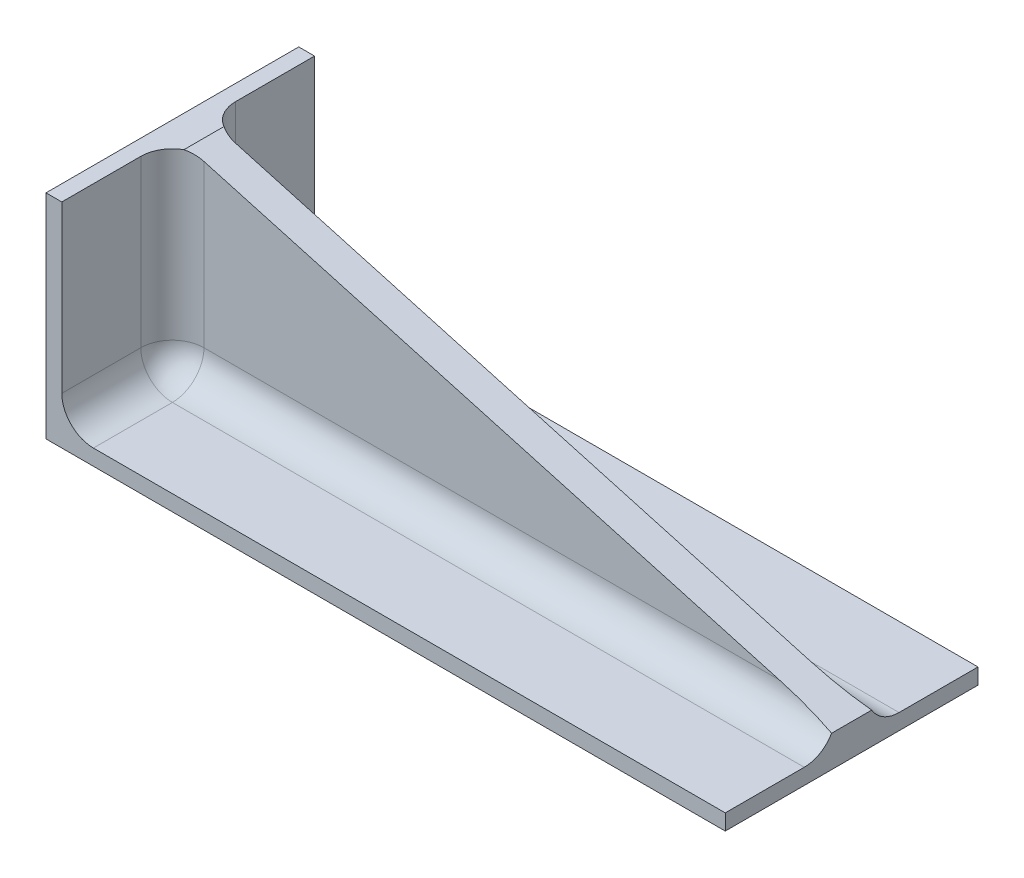
ISO-10303-21;
HEADER;
FILE_DESCRIPTION(('STEP AP214'),'2;1');
FILE_NAME('part.step','',(''),(''),'','','');
FILE_SCHEMA(('AUTOMOTIVE_DESIGN { 1 0 10303 214 1 1 1 1 }'));
ENDSEC;
DATA;
#1=APPLICATION_CONTEXT('core data for automotive mechanical design processes');
#2=APPLICATION_PROTOCOL_DEFINITION('international standard','automotive_design',2000,#1);
#3=PRODUCT_CONTEXT('',#1,'mechanical');
#4=PRODUCT('Part','Part','',(#3));
#5=PRODUCT_RELATED_PRODUCT_CATEGORY('part','',(#4));
#6=PRODUCT_DEFINITION_FORMATION('','',#4);
#7=PRODUCT_DEFINITION_CONTEXT('part definition',#1,'design');
#8=PRODUCT_DEFINITION('design','',#6,#7);
#9=PRODUCT_DEFINITION_SHAPE('','',#8);
#10=(LENGTH_UNIT() NAMED_UNIT(*) SI_UNIT(.MILLI.,.METRE.));
#11=(NAMED_UNIT(*) PLANE_ANGLE_UNIT() SI_UNIT($,.RADIAN.));
#12=(NAMED_UNIT(*) SI_UNIT($,.STERADIAN.) SOLID_ANGLE_UNIT());
#13=UNCERTAINTY_MEASURE_WITH_UNIT(LENGTH_MEASURE(1.E-05),#10,'distance_accuracy_value','');
#14=(GEOMETRIC_REPRESENTATION_CONTEXT(3) GLOBAL_UNCERTAINTY_ASSIGNED_CONTEXT((#13)) GLOBAL_UNIT_ASSIGNED_CONTEXT((#10,
#11,#12)) REPRESENTATION_CONTEXT('',''));
#15=CARTESIAN_POINT('',(0.,0.,0.));
#16=DIRECTION('',(0.,0.,1.));
#17=DIRECTION('',(1.,0.,0.));
#18=AXIS2_PLACEMENT_3D('',#15,#16,#17);
#19=CARTESIAN_POINT('',(0.,6.52256026967279E-13,0.499999999999896));
#20=DIRECTION('',(0.,0.,1.));
#21=DIRECTION('',(1.,0.,0.));
#22=AXIS2_PLACEMENT_3D('',#19,#20,#21);
#23=PLANE('',#22);
#24=DIRECTION('',(0.,-1.00000000000001,0.));
#25=VECTOR('',#24,1.);
#26=CARTESIAN_POINT('',(1.50000000000002,6.52256026967279E-13,0.499999999999884));
#27=LINE('',#26,#25);
#28=CARTESIAN_POINT('',(1.50000000000002,6.60605181463442,0.499999999999971));
#29=VERTEX_POINT('',#28);
#30=CARTESIAN_POINT('',(1.50000000000002,1.50000000000065,0.49999999999995));
#31=VERTEX_POINT('',#30);
#32=EDGE_CURVE('E234',#29,#31,#27,.T.);
#33=ORIENTED_EDGE('',*,*,#32,.T.);
#34=DIRECTION('',(1.,0.,0.));
#35=VECTOR('',#34,1.);
#36=CARTESIAN_POINT('',(0.,1.50000000000065,0.499999999999948));
#37=LINE('',#36,#35);
#38=CARTESIAN_POINT('',(19.7162134188814,1.5000000000007,0.499999999999936));
#39=VERTEX_POINT('',#38);
#40=EDGE_CURVE('E236',#31,#39,#37,.T.);
#41=ORIENTED_EDGE('',*,*,#40,.T.);
#42=DIRECTION('',(-0.962888331678778,0.269900093954894,0.));
#43=VECTOR('',#42,1.);
#44=CARTESIAN_POINT('',(21.5,1.00000000000075,0.499999999999926));
#45=LINE('',#44,#43);
#46=EDGE_CURVE('E203',#39,#29,#45,.T.);
#47=ORIENTED_EDGE('',*,*,#46,.T.);
#48=EDGE_LOOP('',(#33,#41,#47));
#49=FACE_BOUND('',#48,.T.);
#50=ADVANCED_FACE('F32',(#49),#23,.T.);
#51=CARTESIAN_POINT('',(0.,6.24500451351651E-13,-0.50000000000008));
#52=DIRECTION('',(0.,0.,1.));
#53=DIRECTION('',(1.,0.,0.));
#54=AXIS2_PLACEMENT_3D('',#51,#52,#53);
#55=PLANE('',#54);
#56=DIRECTION('',(1.,0.,0.));
#57=VECTOR('',#56,1.);
#58=CARTESIAN_POINT('',(0.500000000000014,1.50000000000038,-0.500000000000091));
#59=LINE('',#58,#57);
#60=CARTESIAN_POINT('',(19.7162134188814,1.5000000000007,-0.500000000000072));
#61=VERTEX_POINT('',#60);
#62=CARTESIAN_POINT('',(1.50000000000002,1.50000000000038,-0.500000000000091));
#63=VERTEX_POINT('',#62);
#64=EDGE_CURVE('E217',#61,#63,#59,.F.);
#65=ORIENTED_EDGE('',*,*,#64,.T.);
#66=DIRECTION('',(0.,-1.00000000000001,0.));
#67=VECTOR('',#66,1.);
#68=CARTESIAN_POINT('',(1.50000000000002,6.74620311000002,-0.500000000000013));
#69=LINE('',#68,#67);
#70=CARTESIAN_POINT('',(1.50000000000002,6.60605181463447,-0.500000000000016));
#71=VERTEX_POINT('',#70);
#72=EDGE_CURVE('E219',#63,#71,#69,.F.);
#73=ORIENTED_EDGE('',*,*,#72,.T.);
#74=DIRECTION('',(-0.962888331678778,0.269900093954894,0.));
#75=VECTOR('',#74,1.);
#76=CARTESIAN_POINT('',(21.5,1.00000000000081,-0.500000000000056));
#77=LINE('',#76,#75);
#78=EDGE_CURVE('E202',#61,#71,#77,.T.);
#79=ORIENTED_EDGE('',*,*,#78,.F.);
#80=EDGE_LOOP('',(#65,#73,#79));
#81=FACE_BOUND('',#80,.T.);
#82=ADVANCED_FACE('F310',(#81),#55,.F.);
#83=CARTESIAN_POINT('',(0.,6.74620311000086,0.500000000000032));
#84=DIRECTION('',(1.,0.,0.));
#85=DIRECTION('',(0.,1.00000000000001,0.));
#86=AXIS2_PLACEMENT_3D('',#83,#84,#85);
#87=PLANE('',#86);
#88=DIRECTION('',(0.,0.,-1.));
#89=VECTOR('',#88,1.);
#90=CARTESIAN_POINT('',(0.,6.74620311000086,0.500000000000032));
#91=LINE('',#90,#89);
#92=CARTESIAN_POINT('',(0.,6.74620311000072,4.00000000000003));
#93=VERTEX_POINT('',#92);
#94=CARTESIAN_POINT('',(0.,6.74620311000056,-4.00000000000005));
#95=VERTEX_POINT('',#94);
#96=EDGE_CURVE('E206',#93,#95,#91,.T.);
#97=ORIENTED_EDGE('',*,*,#96,.T.);
#98=DIRECTION('',(0.,-1.00000000000001,0.));
#99=VECTOR('',#98,1.);
#100=CARTESIAN_POINT('',(0.,4.30211422042248E-13,-4.00000000000006));
#101=LINE('',#100,#99);
#102=CARTESIAN_POINT('',(0.,4.30211422042248E-13,-4.00000000000006));
#103=VERTEX_POINT('',#102);
#104=EDGE_CURVE('E152',#95,#103,#101,.T.);
#105=ORIENTED_EDGE('',*,*,#104,.T.);
#106=DIRECTION('',(0.,0.,-1.));
#107=VECTOR('',#106,1.);
#108=CARTESIAN_POINT('',(0.,6.52256026967279E-13,0.499999999999896));
#109=LINE('',#108,#107);
#110=CARTESIAN_POINT('',(0.,4.71844785465692E-13,3.99999999999988));
#111=VERTEX_POINT('',#110);
#112=EDGE_CURVE('E146',#111,#103,#109,.T.);
#113=ORIENTED_EDGE('',*,*,#112,.F.);
#114=DIRECTION('',(0.,-1.00000000000001,0.));
#115=VECTOR('',#114,1.);
#116=CARTESIAN_POINT('',(0.,4.71844785465692E-13,3.99999999999988));
#117=LINE('',#116,#115);
#118=EDGE_CURVE('E150',#93,#111,#117,.T.);
#119=ORIENTED_EDGE('',*,*,#118,.F.);
#120=EDGE_LOOP('',(#97,#105,#113,#119));
#121=FACE_BOUND('',#120,.T.);
#122=ADVANCED_FACE('F148',(#121),#87,.F.);
#123=CARTESIAN_POINT('',(0.,6.52256026967279E-13,0.499999999999896));
#124=DIRECTION('',(0.,1.00000000000001,0.));
#125=DIRECTION('',(0.,0.,1.));
#126=AXIS2_PLACEMENT_3D('',#123,#124,#125);
#127=PLANE('',#126);
#128=ORIENTED_EDGE('',*,*,#112,.T.);
#129=DIRECTION('',(1.,0.,0.));
#130=VECTOR('',#129,1.);
#131=CARTESIAN_POINT('',(21.5,6.10622663543836E-13,-4.00000000000003));
#132=LINE('',#131,#130);
#133=CARTESIAN_POINT('',(21.5,6.10622663543836E-13,-4.00000000000003));
#134=VERTEX_POINT('',#133);
#135=EDGE_CURVE('E185',#103,#134,#132,.T.);
#136=ORIENTED_EDGE('',*,*,#135,.T.);
#137=DIRECTION('',(0.,0.,-1.));
#138=VECTOR('',#137,1.);
#139=CARTESIAN_POINT('',(21.5,8.04911692853238E-13,0.499999999999876));
#140=LINE('',#139,#138);
#141=CARTESIAN_POINT('',(21.5,4.30211422042248E-13,3.99999999999985));
#142=VERTEX_POINT('',#141);
#143=EDGE_CURVE('E157',#142,#134,#140,.T.);
#144=ORIENTED_EDGE('',*,*,#143,.F.);
#145=DIRECTION('',(1.,0.,0.));
#146=VECTOR('',#145,1.);
#147=CARTESIAN_POINT('',(21.5,4.30211422042248E-13,3.99999999999985));
#148=LINE('',#147,#146);
#149=EDGE_CURVE('E160',#111,#142,#148,.T.);
#150=ORIENTED_EDGE('',*,*,#149,.F.);
#151=EDGE_LOOP('',(#128,#136,#144,#150));
#152=FACE_BOUND('',#151,.T.);
#153=ADVANCED_FACE('F161',(#152),#127,.F.);
#154=CARTESIAN_POINT('',(21.5,8.04911692853238E-13,0.499999999999876));
#155=DIRECTION('',(-1.,0.,0.));
#156=DIRECTION('',(0.,0.,1.));
#157=AXIS2_PLACEMENT_3D('',#154,#155,#156);
#158=PLANE('',#157);
#159=ORIENTED_EDGE('',*,*,#143,.T.);
#160=DIRECTION('',(0.,1.00000000000001,0.));
#161=VECTOR('',#160,1.);
#162=CARTESIAN_POINT('',(21.5,0.500000000000528,-4.00000000000004));
#163=LINE('',#162,#161);
#164=CARTESIAN_POINT('',(21.5,0.500000000000528,-4.00000000000004));
#165=VERTEX_POINT('',#164);
#166=EDGE_CURVE('E188',#134,#165,#163,.T.);
#167=ORIENTED_EDGE('',*,*,#166,.T.);
#168=DIRECTION('',(0.,0.,-1.));
#169=VECTOR('',#168,1.);
#170=CARTESIAN_POINT('',(21.5,0.500000000000556,3.99999999999993));
#171=LINE('',#170,#169);
#172=CARTESIAN_POINT('',(21.5,0.500000000000972,-1.50000000000008));
#173=VERTEX_POINT('',#172);
#174=EDGE_CURVE('E198',#173,#165,#171,.T.);
#175=ORIENTED_EDGE('',*,*,#174,.F.);
#176=CARTESIAN_POINT('',(21.5,1.50000000000089,-1.50000000000007));
#177=DIRECTION('',(-1.,0.,0.));
#178=DIRECTION('',(0.,0.,1.));
#179=AXIS2_PLACEMENT_3D('',#176,#177,#178);
#180=CIRCLE('',#179,1.);
#181=CARTESIAN_POINT('',(21.5,1.00000000000088,-0.633974596215661));
#182=VERTEX_POINT('',#181);
#183=EDGE_CURVE('E244',#173,#182,#180,.T.);
#184=ORIENTED_EDGE('',*,*,#183,.T.);
#185=DIRECTION('',(0.,0.,-1.));
#186=VECTOR('',#185,1.);
#187=CARTESIAN_POINT('',(21.5,1.00000000000075,0.499999999999926));
#188=LINE('',#187,#186);
#189=CARTESIAN_POINT('',(21.5,1.00000000000067,0.633974596215505));
#190=VERTEX_POINT('',#189);
#191=EDGE_CURVE('E56',#190,#182,#188,.T.);
#192=ORIENTED_EDGE('',*,*,#191,.F.);
#193=CARTESIAN_POINT('',(21.5,1.50000000000064,1.49999999999992));
#194=DIRECTION('',(-1.,0.,0.));
#195=DIRECTION('',(0.,0.,1.));
#196=AXIS2_PLACEMENT_3D('',#193,#194,#195);
#197=CIRCLE('',#196,1.);
#198=CARTESIAN_POINT('',(21.5,0.500000000000667,1.49999999999993));
#199=VERTEX_POINT('',#198);
#200=EDGE_CURVE('E252',#190,#199,#197,.T.);
#201=ORIENTED_EDGE('',*,*,#200,.T.);
#202=CARTESIAN_POINT('',(21.5,0.500000000000556,3.99999999999993));
#203=VERTEX_POINT('',#202);
#204=EDGE_CURVE('E199',#203,#199,#171,.T.);
#205=ORIENTED_EDGE('',*,*,#204,.F.);
#206=DIRECTION('',(0.,1.00000000000001,0.));
#207=VECTOR('',#206,1.);
#208=CARTESIAN_POINT('',(21.5,0.500000000000556,3.99999999999993));
#209=LINE('',#208,#207);
#210=EDGE_CURVE('E164',#142,#203,#209,.T.);
#211=ORIENTED_EDGE('',*,*,#210,.F.);
#212=EDGE_LOOP('',(#159,#167,#175,#184,#192,#201,#205,#211));
#213=FACE_BOUND('',#212,.T.);
#214=ADVANCED_FACE('F290',(#213),#158,.F.);
#215=CARTESIAN_POINT('',(21.5,1.00000000000075,0.499999999999926));
#216=DIRECTION('',(-0.269900093954893,-0.962888331678785,0.));
#217=DIRECTION('',(0.962888331678778,-0.269900093954894,0.));
#218=AXIS2_PLACEMENT_3D('',#215,#216,#217);
#219=PLANE('',#218);
#220=ORIENTED_EDGE('',*,*,#191,.T.);
#221=CARTESIAN_POINT('',(19.7162134188814,1.50000000000071,-1.50000000000004));
#222=DIRECTION('',(-0.269900093954893,-0.962888331678785,0.));
#223=DIRECTION('',(-0.962888331678778,0.269900093954894,0.));
#224=AXIS2_PLACEMENT_3D('',#221,#222,#223);
#225=ELLIPSE('',#224,3.70507466428346,1.);
#226=EDGE_CURVE('E246',#182,#61,#225,.T.);
#227=ORIENTED_EDGE('',*,*,#226,.T.);
#228=ORIENTED_EDGE('',*,*,#78,.T.);
#229=CARTESIAN_POINT('',(1.5,6.60605181463453,-1.50000000000006));
#230=DIRECTION('',(-0.269900093954893,-0.962888331678785,0.));
#231=DIRECTION('',(-0.962888331678778,0.269900093954894,0.));
#232=AXIS2_PLACEMENT_3D('',#229,#230,#231);
#233=ELLIPSE('',#232,1.03854202725307,1.);
#234=CARTESIAN_POINT('',(1.00000000000001,6.74620311000004,-0.633974596215607));
#235=VERTEX_POINT('',#234);
#236=EDGE_CURVE('E238',#71,#235,#233,.T.);
#237=ORIENTED_EDGE('',*,*,#236,.T.);
#238=DIRECTION('',(0.,0.,-1.));
#239=VECTOR('',#238,1.);
#240=CARTESIAN_POINT('',(1.00000000000001,6.74620311000086,0.500000000000032));
#241=LINE('',#240,#239);
#242=CARTESIAN_POINT('',(1.00000000000001,6.74620311000014,0.633974596215491));
#243=VERTEX_POINT('',#242);
#244=EDGE_CURVE('E48',#243,#235,#241,.T.);
#245=ORIENTED_EDGE('',*,*,#244,.F.);
#246=CARTESIAN_POINT('',(1.5,6.60605181463474,1.49999999999996));
#247=DIRECTION('',(-0.269900093954893,-0.962888331678785,0.));
#248=DIRECTION('',(0.962888331678778,-0.269900093954894,0.));
#249=AXIS2_PLACEMENT_3D('',#246,#247,#248);
#250=ELLIPSE('',#249,1.03854202725307,1.);
#251=EDGE_CURVE('E11',#243,#29,#250,.T.);
#252=ORIENTED_EDGE('',*,*,#251,.T.);
#253=ORIENTED_EDGE('',*,*,#46,.F.);
#254=CARTESIAN_POINT('',(19.7162134188814,1.50000000000067,1.49999999999997));
#255=DIRECTION('',(-0.269900093954893,-0.962888331678785,0.));
#256=DIRECTION('',(0.962888331678778,-0.269900093954894,0.));
#257=AXIS2_PLACEMENT_3D('',#254,#255,#256);
#258=ELLIPSE('',#257,3.70507466428346,1.);
#259=EDGE_CURVE('E250',#39,#190,#258,.T.);
#260=ORIENTED_EDGE('',*,*,#259,.T.);
#261=EDGE_LOOP('',(#220,#227,#228,#237,#245,#252,#253,#260));
#262=FACE_BOUND('',#261,.T.);
#263=ADVANCED_FACE('F298',(#262),#219,.F.);
#264=CARTESIAN_POINT('',(1.00000000000001,6.74620311000086,0.500000000000032));
#265=DIRECTION('',(0.,-1.00000000000001,0.));
#266=DIRECTION('',(0.,0.,-1.));
#267=AXIS2_PLACEMENT_3D('',#264,#265,#266);
#268=PLANE('',#267);
#269=ORIENTED_EDGE('',*,*,#96,.F.);
#270=DIRECTION('',(-1.,0.,0.));
#271=VECTOR('',#270,1.);
#272=CARTESIAN_POINT('',(0.,6.74620311000072,4.00000000000003));
#273=LINE('',#272,#271);
#274=CARTESIAN_POINT('',(0.500000000000014,6.74620311000081,4.00000000000002));
#275=VERTEX_POINT('',#274);
#276=EDGE_CURVE('E169',#275,#93,#273,.T.);
#277=ORIENTED_EDGE('',*,*,#276,.F.);
#278=DIRECTION('',(0.,0.,-1.));
#279=VECTOR('',#278,1.);
#280=CARTESIAN_POINT('',(0.500000000000014,6.74620311000081,4.00000000000002));
#281=LINE('',#280,#279);
#282=CARTESIAN_POINT('',(0.500000000000014,6.74620311000085,1.49999999999994));
#283=VERTEX_POINT('',#282);
#284=EDGE_CURVE('E195',#275,#283,#281,.T.);
#285=ORIENTED_EDGE('',*,*,#284,.T.);
#286=CARTESIAN_POINT('',(1.50000000000002,6.74620311000085,1.49999999999994));
#287=DIRECTION('',(0.,-1.00000000000001,0.));
#288=DIRECTION('',(0.,0.,-1.));
#289=AXIS2_PLACEMENT_3D('',#286,#287,#288);
#290=CIRCLE('',#289,1.);
#291=EDGE_CURVE('E41',#283,#243,#290,.T.);
#292=ORIENTED_EDGE('',*,*,#291,.T.);
#293=ORIENTED_EDGE('',*,*,#244,.T.);
#294=CARTESIAN_POINT('',(1.5,6.74620311000029,-1.50000000000008));
#295=DIRECTION('',(0.,-1.00000000000001,0.));
#296=DIRECTION('',(0.,0.,-1.));
#297=AXIS2_PLACEMENT_3D('',#294,#295,#296);
#298=CIRCLE('',#297,1.);
#299=CARTESIAN_POINT('',(0.5,6.74620311000029,-1.50000000000008));
#300=VERTEX_POINT('',#299);
#301=EDGE_CURVE('E240',#235,#300,#298,.T.);
#302=ORIENTED_EDGE('',*,*,#301,.T.);
#303=CARTESIAN_POINT('',(0.500000000000014,6.74620311000057,-4.00000000000005));
#304=VERTEX_POINT('',#303);
#305=EDGE_CURVE('E183',#300,#304,#281,.T.);
#306=ORIENTED_EDGE('',*,*,#305,.T.);
#307=DIRECTION('',(-1.,0.,0.));
#308=VECTOR('',#307,1.);
#309=CARTESIAN_POINT('',(0.,6.74620311000056,-4.00000000000005));
#310=LINE('',#309,#308);
#311=EDGE_CURVE('E170',#304,#95,#310,.T.);
#312=ORIENTED_EDGE('',*,*,#311,.T.);
#313=EDGE_LOOP('',(#269,#277,#285,#292,#293,#302,#306,#312));
#314=FACE_BOUND('',#313,.T.);
#315=ADVANCED_FACE('F320',(#314),#268,.F.);
#316=CARTESIAN_POINT('',(0.,6.74620311000056,-4.00000000000005));
#317=DIRECTION('',(0.,0.,-1.));
#318=DIRECTION('',(-1.,0.,0.));
#319=AXIS2_PLACEMENT_3D('',#316,#317,#318);
#320=PLANE('',#319);
#321=ORIENTED_EDGE('',*,*,#104,.F.);
#322=ORIENTED_EDGE('',*,*,#311,.F.);
#323=DIRECTION('',(0.,1.00000000000001,0.));
#324=VECTOR('',#323,1.);
#325=CARTESIAN_POINT('',(0.500000000000014,6.74620311000057,-4.00000000000005));
#326=LINE('',#325,#324);
#327=CARTESIAN_POINT('',(0.500000000000014,1.50000000000022,-4.00000000000013));
#328=VERTEX_POINT('',#327);
#329=EDGE_CURVE('E173',#328,#304,#326,.T.);
#330=ORIENTED_EDGE('',*,*,#329,.F.);
#331=CARTESIAN_POINT('',(1.50000000000002,1.50000000000022,-4.00000000000013));
#332=DIRECTION('',(0.,0.,-1.));
#333=DIRECTION('',(-1.,0.,0.));
#334=AXIS2_PLACEMENT_3D('',#331,#332,#333);
#335=CIRCLE('',#334,1.);
#336=CARTESIAN_POINT('',(1.50000000000002,0.500000000000375,-4.00000000000007));
#337=VERTEX_POINT('',#336);
#338=EDGE_CURVE('E242',#328,#337,#335,.F.);
#339=ORIENTED_EDGE('',*,*,#338,.T.);
#340=DIRECTION('',(-1.,0.,0.));
#341=VECTOR('',#340,1.);
#342=CARTESIAN_POINT('',(0.500000000000014,0.500000000000375,-4.00000000000007));
#343=LINE('',#342,#341);
#344=EDGE_CURVE('E191',#165,#337,#343,.T.);
#345=ORIENTED_EDGE('',*,*,#344,.F.);
#346=ORIENTED_EDGE('',*,*,#166,.F.);
#347=ORIENTED_EDGE('',*,*,#135,.F.);
#348=EDGE_LOOP('',(#321,#322,#330,#339,#345,#346,#347));
#349=FACE_BOUND('',#348,.T.);
#350=ADVANCED_FACE('F328',(#349),#320,.T.);
#351=CARTESIAN_POINT('',(0.500000000000014,6.74620311000081,4.00000000000002));
#352=DIRECTION('',(-1.,0.,0.));
#353=DIRECTION('',(0.,-1.00000000000001,0.));
#354=AXIS2_PLACEMENT_3D('',#351,#352,#353);
#355=PLANE('',#354);
#356=ORIENTED_EDGE('',*,*,#305,.F.);
#357=DIRECTION('',(0.,-1.00000000000001,0.));
#358=VECTOR('',#357,1.);
#359=CARTESIAN_POINT('',(0.500000000000014,0.500000000000944,-1.50000000000006));
#360=LINE('',#359,#358);
#361=CARTESIAN_POINT('',(0.500000000000014,1.50000000000051,-1.50000000000001));
#362=VERTEX_POINT('',#361);
#363=EDGE_CURVE('E214',#300,#362,#360,.T.);
#364=ORIENTED_EDGE('',*,*,#363,.T.);
#365=DIRECTION('',(0.,0.,-1.));
#366=VECTOR('',#365,1.);
#367=CARTESIAN_POINT('',(0.500000000000014,1.50000000000022,-4.00000000000013));
#368=LINE('',#367,#366);
#369=EDGE_CURVE('E156',#362,#328,#368,.T.);
#370=ORIENTED_EDGE('',*,*,#369,.T.);
#371=ORIENTED_EDGE('',*,*,#329,.T.);
#372=EDGE_LOOP('',(#356,#364,#370,#371));
#373=FACE_BOUND('',#372,.T.);
#374=ADVANCED_FACE('F323',(#373),#355,.F.);
#375=CARTESIAN_POINT('',(0.500000000000014,0.500000000000556,3.99999999999991));
#376=DIRECTION('',(0.,-1.00000000000001,0.));
#377=DIRECTION('',(0.,0.,-1.));
#378=AXIS2_PLACEMENT_3D('',#375,#376,#377);
#379=PLANE('',#378);
#380=ORIENTED_EDGE('',*,*,#344,.T.);
#381=DIRECTION('',(0.,0.,-1.));
#382=VECTOR('',#381,1.);
#383=CARTESIAN_POINT('',(1.50000000000002,0.500000000000611,-0.500000000000127));
#384=LINE('',#383,#382);
#385=CARTESIAN_POINT('',(1.50000000000002,0.50000000000093,-1.50000000000006));
#386=VERTEX_POINT('',#385);
#387=EDGE_CURVE('E223',#337,#386,#384,.F.);
#388=ORIENTED_EDGE('',*,*,#387,.T.);
#389=DIRECTION('',(1.,0.,0.));
#390=VECTOR('',#389,1.);
#391=CARTESIAN_POINT('',(21.5,0.500000000000972,-1.50000000000008));
#392=LINE('',#391,#390);
#393=EDGE_CURVE('E221',#386,#173,#392,.T.);
#394=ORIENTED_EDGE('',*,*,#393,.T.);
#395=ORIENTED_EDGE('',*,*,#174,.T.);
#396=EDGE_LOOP('',(#380,#388,#394,#395));
#397=FACE_BOUND('',#396,.T.);
#398=ADVANCED_FACE('F335',(#397),#379,.F.);
#399=DIRECTION('',(1.,0.,0.));
#400=VECTOR('',#399,1.);
#401=CARTESIAN_POINT('',(0.5,0.500000000000708,1.49999999999996));
#402=LINE('',#401,#400);
#403=CARTESIAN_POINT('',(1.5,0.500000000000736,1.49999999999996));
#404=VERTEX_POINT('',#403);
#405=EDGE_CURVE('E230',#199,#404,#402,.F.);
#406=ORIENTED_EDGE('',*,*,#405,.T.);
#407=DIRECTION('',(0.,0.,-1.));
#408=VECTOR('',#407,1.);
#409=CARTESIAN_POINT('',(1.50000000000002,0.500000000000556,3.99999999999991));
#410=LINE('',#409,#408);
#411=CARTESIAN_POINT('',(1.50000000000002,0.500000000000556,3.99999999999991));
#412=VERTEX_POINT('',#411);
#413=EDGE_CURVE('E232',#404,#412,#410,.F.);
#414=ORIENTED_EDGE('',*,*,#413,.T.);
#415=DIRECTION('',(-1.,0.,0.));
#416=VECTOR('',#415,1.);
#417=CARTESIAN_POINT('',(0.500000000000014,0.500000000000556,3.99999999999991));
#418=LINE('',#417,#416);
#419=EDGE_CURVE('E177',#203,#412,#418,.T.);
#420=ORIENTED_EDGE('',*,*,#419,.F.);
#421=ORIENTED_EDGE('',*,*,#204,.T.);
#422=EDGE_LOOP('',(#406,#414,#420,#421));
#423=FACE_BOUND('',#422,.T.);
#424=ADVANCED_FACE('F287',(#423),#379,.F.);
#425=DIRECTION('',(0.,1.00000000000001,0.));
#426=VECTOR('',#425,1.);
#427=CARTESIAN_POINT('',(0.500000000000014,6.74620311000081,4.00000000000002));
#428=LINE('',#427,#426);
#429=CARTESIAN_POINT('',(0.500000000000014,1.50000000000056,3.99999999999993));
#430=VERTEX_POINT('',#429);
#431=EDGE_CURVE('E180',#430,#275,#428,.T.);
#432=ORIENTED_EDGE('',*,*,#431,.F.);
#433=DIRECTION('',(0.,0.,-1.));
#434=VECTOR('',#433,1.);
#435=CARTESIAN_POINT('',(0.500000000000014,1.50000000000065,0.499999999999954));
#436=LINE('',#435,#434);
#437=CARTESIAN_POINT('',(0.5,1.50000000000072,1.50000000000001));
#438=VERTEX_POINT('',#437);
#439=EDGE_CURVE('E227',#430,#438,#436,.T.);
#440=ORIENTED_EDGE('',*,*,#439,.T.);
#441=DIRECTION('',(0.,-1.00000000000001,0.));
#442=VECTOR('',#441,1.);
#443=CARTESIAN_POINT('',(0.500000000000014,6.74620311000085,1.49999999999994));
#444=LINE('',#443,#442);
#445=EDGE_CURVE('E225',#438,#283,#444,.F.);
#446=ORIENTED_EDGE('',*,*,#445,.T.);
#447=ORIENTED_EDGE('',*,*,#284,.F.);
#448=EDGE_LOOP('',(#432,#440,#446,#447));
#449=FACE_BOUND('',#448,.T.);
#450=ADVANCED_FACE('F280',(#449),#355,.F.);
#451=CARTESIAN_POINT('',(0.,6.74620311000072,4.00000000000003));
#452=DIRECTION('',(0.,0.,-1.));
#453=DIRECTION('',(-1.,0.,0.));
#454=AXIS2_PLACEMENT_3D('',#451,#452,#453);
#455=PLANE('',#454);
#456=ORIENTED_EDGE('',*,*,#118,.T.);
#457=ORIENTED_EDGE('',*,*,#149,.T.);
#458=ORIENTED_EDGE('',*,*,#210,.T.);
#459=ORIENTED_EDGE('',*,*,#419,.T.);
#460=CARTESIAN_POINT('',(1.50000000000002,1.50000000000056,3.99999999999993));
#461=DIRECTION('',(0.,0.,-1.));
#462=DIRECTION('',(-1.,0.,0.));
#463=AXIS2_PLACEMENT_3D('',#460,#461,#462);
#464=CIRCLE('',#463,1.);
#465=EDGE_CURVE('E248',#412,#430,#464,.T.);
#466=ORIENTED_EDGE('',*,*,#465,.T.);
#467=ORIENTED_EDGE('',*,*,#431,.T.);
#468=ORIENTED_EDGE('',*,*,#276,.T.);
#469=EDGE_LOOP('',(#456,#457,#458,#459,#466,#467,#468));
#470=FACE_BOUND('',#469,.T.);
#471=ADVANCED_FACE('F167',(#470),#455,.F.);
#472=CARTESIAN_POINT('',(1.50000000000002,1.50000000000056,3.99999999999993));
#473=DIRECTION('',(0.,0.,1.));
#474=DIRECTION('',(1.,0.,0.));
#475=AXIS2_PLACEMENT_3D('',#472,#473,#474);
#476=CYLINDRICAL_SURFACE('',#475,1.);
#477=ORIENTED_EDGE('',*,*,#338,.F.);
#478=ORIENTED_EDGE('',*,*,#369,.F.);
#479=CARTESIAN_POINT('',(1.50000000000002,1.50000000000051,-1.50000000000001));
#480=DIRECTION('',(0.,0.,-1.));
#481=DIRECTION('',(-1.,0.,0.));
#482=AXIS2_PLACEMENT_3D('',#479,#480,#481);
#483=CIRCLE('',#482,1.);
#484=EDGE_CURVE('E186',#386,#362,#483,.T.);
#485=ORIENTED_EDGE('',*,*,#484,.F.);
#486=ORIENTED_EDGE('',*,*,#387,.F.);
#487=EDGE_LOOP('',(#477,#478,#485,#486));
#488=FACE_BOUND('',#487,.T.);
#489=ADVANCED_FACE('F332',(#488),#476,.F.);
#490=CARTESIAN_POINT('',(0.500000000000014,1.50000000000051,-1.50000000000001));
#491=DIRECTION('',(-1.,0.,0.));
#492=DIRECTION('',(0.,0.,1.));
#493=AXIS2_PLACEMENT_3D('',#490,#491,#492);
#494=CYLINDRICAL_SURFACE('',#493,1.);
#495=ORIENTED_EDGE('',*,*,#183,.F.);
#496=ORIENTED_EDGE('',*,*,#393,.F.);
#497=CARTESIAN_POINT('',(1.50000000000002,1.50000000000051,-1.50000000000001));
#498=DIRECTION('',(1.,0.,0.));
#499=DIRECTION('',(0.,0.,-1.));
#500=AXIS2_PLACEMENT_3D('',#497,#498,#499);
#501=CIRCLE('',#500,1.);
#502=EDGE_CURVE('E257',#63,#386,#501,.T.);
#503=ORIENTED_EDGE('',*,*,#502,.F.);
#504=ORIENTED_EDGE('',*,*,#64,.F.);
#505=ORIENTED_EDGE('',*,*,#226,.F.);
#506=EDGE_LOOP('',(#495,#496,#503,#504,#505));
#507=FACE_BOUND('',#506,.T.);
#508=ADVANCED_FACE('F306',(#507),#494,.F.);
#509=CARTESIAN_POINT('',(1.50000000000002,1.50000000000051,-1.50000000000001));
#510=DIRECTION('',(0.,0.,1.));
#511=DIRECTION('',(1.,0.,0.));
#512=AXIS2_PLACEMENT_3D('',#509,#510,#511);
#513=SPHERICAL_SURFACE('',#512,1.);
#514=ORIENTED_EDGE('',*,*,#502,.T.);
#515=ORIENTED_EDGE('',*,*,#484,.T.);
#516=CARTESIAN_POINT('',(1.50000000000002,1.50000000000051,-1.50000000000001));
#517=DIRECTION('',(0.,1.00000000000001,0.));
#518=DIRECTION('',(-1.,0.,0.));
#519=AXIS2_PLACEMENT_3D('',#516,#517,#518);
#520=CIRCLE('',#519,1.);
#521=EDGE_CURVE('E255',#63,#362,#520,.F.);
#522=ORIENTED_EDGE('',*,*,#521,.F.);
#523=EDGE_LOOP('',(#514,#515,#522));
#524=FACE_BOUND('',#523,.T.);
#525=ADVANCED_FACE('F363',(#524),#513,.F.);
#526=CARTESIAN_POINT('',(1.5,6.74620311000029,-1.50000000000008));
#527=DIRECTION('',(0.,1.00000000000001,0.));
#528=DIRECTION('',(-1.,0.,0.));
#529=AXIS2_PLACEMENT_3D('',#526,#527,#528);
#530=CYLINDRICAL_SURFACE('',#529,1.);
#531=ORIENTED_EDGE('',*,*,#236,.F.);
#532=ORIENTED_EDGE('',*,*,#72,.F.);
#533=ORIENTED_EDGE('',*,*,#521,.T.);
#534=ORIENTED_EDGE('',*,*,#363,.F.);
#535=ORIENTED_EDGE('',*,*,#301,.F.);
#536=EDGE_LOOP('',(#531,#532,#533,#534,#535));
#537=FACE_BOUND('',#536,.T.);
#538=ADVANCED_FACE('F314',(#537),#530,.F.);
#539=CARTESIAN_POINT('',(1.5,5.13478148889135E-13,1.49999999999989));
#540=DIRECTION('',(0.,-1.00000000000001,0.));
#541=DIRECTION('',(1.,0.,0.));
#542=AXIS2_PLACEMENT_3D('',#539,#540,#541);
#543=CYLINDRICAL_SURFACE('',#542,1.);
#544=ORIENTED_EDGE('',*,*,#291,.F.);
#545=ORIENTED_EDGE('',*,*,#445,.F.);
#546=CARTESIAN_POINT('',(1.5,1.50000000000095,1.50000000000004));
#547=DIRECTION('',(0.,1.00000000000001,0.));
#548=DIRECTION('',(-1.,0.,0.));
#549=AXIS2_PLACEMENT_3D('',#546,#547,#548);
#550=CIRCLE('',#549,1.);
#551=EDGE_CURVE('E36',#31,#438,#550,.T.);
#552=ORIENTED_EDGE('',*,*,#551,.F.);
#553=ORIENTED_EDGE('',*,*,#32,.F.);
#554=ORIENTED_EDGE('',*,*,#251,.F.);
#555=EDGE_LOOP('',(#544,#545,#552,#553,#554));
#556=FACE_BOUND('',#555,.T.);
#557=ADVANCED_FACE('F34',(#556),#543,.F.);
#558=CARTESIAN_POINT('',(0.,1.50000000000072,1.50000000000001));
#559=DIRECTION('',(1.,0.,0.));
#560=DIRECTION('',(0.,0.,-1.));
#561=AXIS2_PLACEMENT_3D('',#558,#559,#560);
#562=CYLINDRICAL_SURFACE('',#561,1.);
#563=ORIENTED_EDGE('',*,*,#259,.F.);
#564=ORIENTED_EDGE('',*,*,#40,.F.);
#565=CARTESIAN_POINT('',(1.5,1.50000000000095,1.50000000000004));
#566=DIRECTION('',(1.,0.,0.));
#567=DIRECTION('',(0.,0.,-1.));
#568=AXIS2_PLACEMENT_3D('',#565,#566,#567);
#569=CIRCLE('',#568,1.);
#570=EDGE_CURVE('E263',#404,#31,#569,.T.);
#571=ORIENTED_EDGE('',*,*,#570,.F.);
#572=ORIENTED_EDGE('',*,*,#405,.F.);
#573=ORIENTED_EDGE('',*,*,#200,.F.);
#574=EDGE_LOOP('',(#563,#564,#571,#572,#573));
#575=FACE_BOUND('',#574,.T.);
#576=ADVANCED_FACE('F294',(#575),#562,.F.);
#577=CARTESIAN_POINT('',(1.5,1.50000000000095,1.50000000000004));
#578=DIRECTION('',(0.,0.,1.));
#579=DIRECTION('',(1.,0.,0.));
#580=AXIS2_PLACEMENT_3D('',#577,#578,#579);
#581=SPHERICAL_SURFACE('',#580,1.);
#582=ORIENTED_EDGE('',*,*,#570,.T.);
#583=ORIENTED_EDGE('',*,*,#551,.T.);
#584=CARTESIAN_POINT('',(1.5,1.50000000000095,1.50000000000004));
#585=DIRECTION('',(0.,0.,1.));
#586=DIRECTION('',(1.,0.,0.));
#587=AXIS2_PLACEMENT_3D('',#584,#585,#586);
#588=CIRCLE('',#587,1.);
#589=EDGE_CURVE('E262',#404,#438,#588,.F.);
#590=ORIENTED_EDGE('',*,*,#589,.F.);
#591=EDGE_LOOP('',(#582,#583,#590));
#592=FACE_BOUND('',#591,.T.);
#593=ADVANCED_FACE('F271',(#592),#581,.F.);
#594=CARTESIAN_POINT('',(1.50000000000002,1.50000000000056,3.99999999999993));
#595=DIRECTION('',(0.,0.,1.));
#596=DIRECTION('',(1.,0.,0.));
#597=AXIS2_PLACEMENT_3D('',#594,#595,#596);
#598=CYLINDRICAL_SURFACE('',#597,1.);
#599=ORIENTED_EDGE('',*,*,#465,.F.);
#600=ORIENTED_EDGE('',*,*,#413,.F.);
#601=ORIENTED_EDGE('',*,*,#589,.T.);
#602=ORIENTED_EDGE('',*,*,#439,.F.);
#603=EDGE_LOOP('',(#599,#600,#601,#602));
#604=FACE_BOUND('',#603,.T.);
#605=ADVANCED_FACE('F283',(#604),#598,.F.);
#606=CLOSED_SHELL('',(#50,#82,#122,#153,#214,#263,#315,#350,#374,#398,#424,#450,#471,#489,#508,
#525,#538,#557,#576,#593,#605));
#607=MANIFOLD_SOLID_BREP('B2',#606);
#608=ADVANCED_BREP_SHAPE_REPRESENTATION('',(#18,#607),#14);
#609=SHAPE_DEFINITION_REPRESENTATION(#9,#608);
ENDSEC;
END-ISO-10303-21;
